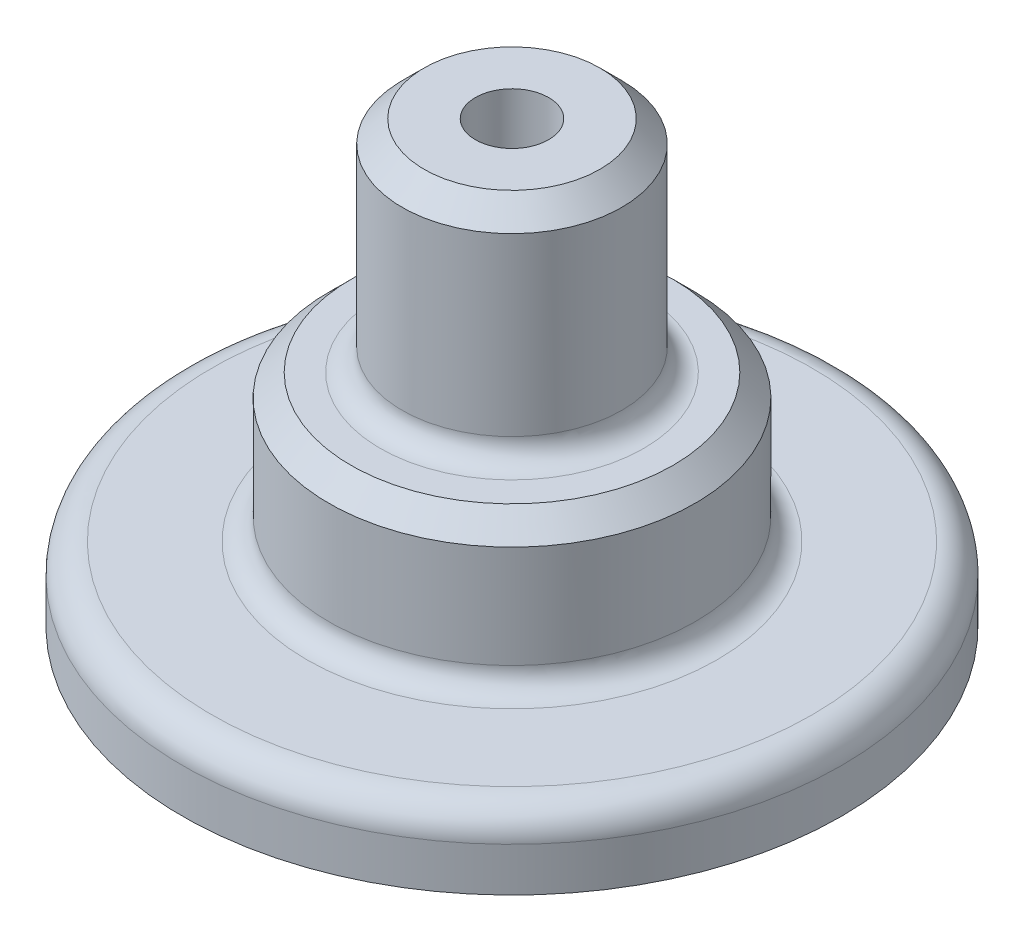
ISO-10303-21;
HEADER;
FILE_DESCRIPTION(('STEP AP214'),'2;1');
FILE_NAME('part.step','',(''),(''),'','','');
FILE_SCHEMA(('AUTOMOTIVE_DESIGN { 1 0 10303 214 1 1 1 1 }'));
ENDSEC;
DATA;
#1=APPLICATION_CONTEXT('core data for automotive mechanical design processes');
#2=APPLICATION_PROTOCOL_DEFINITION('international standard','automotive_design',2000,#1);
#3=PRODUCT_CONTEXT('',#1,'mechanical');
#4=PRODUCT('Part','Part','',(#3));
#5=PRODUCT_RELATED_PRODUCT_CATEGORY('part','',(#4));
#6=PRODUCT_DEFINITION_FORMATION('','',#4);
#7=PRODUCT_DEFINITION_CONTEXT('part definition',#1,'design');
#8=PRODUCT_DEFINITION('design','',#6,#7);
#9=PRODUCT_DEFINITION_SHAPE('','',#8);
#10=(LENGTH_UNIT() NAMED_UNIT(*) SI_UNIT(.MILLI.,.METRE.));
#11=(NAMED_UNIT(*) PLANE_ANGLE_UNIT() SI_UNIT($,.RADIAN.));
#12=(NAMED_UNIT(*) SI_UNIT($,.STERADIAN.) SOLID_ANGLE_UNIT());
#13=UNCERTAINTY_MEASURE_WITH_UNIT(LENGTH_MEASURE(1.E-05),#10,'distance_accuracy_value','');
#14=(GEOMETRIC_REPRESENTATION_CONTEXT(3) GLOBAL_UNCERTAINTY_ASSIGNED_CONTEXT((#13)) GLOBAL_UNIT_ASSIGNED_CONTEXT((#10,
#11,#12)) REPRESENTATION_CONTEXT('',''));
#15=CARTESIAN_POINT('',(0.,0.,0.));
#16=DIRECTION('',(0.,0.,1.));
#17=DIRECTION('',(1.,0.,0.));
#18=AXIS2_PLACEMENT_3D('',#15,#16,#17);
#19=CARTESIAN_POINT('',(40.,120.,0.));
#20=DIRECTION('',(0.,-1.,0.));
#21=DIRECTION('',(1.,0.,0.));
#22=AXIS2_PLACEMENT_3D('',#19,#20,#21);
#23=PLANE('',#22);
#24=CARTESIAN_POINT('',(9.99999999999999,120.,0.));
#25=DIRECTION('',(0.,-1.,0.));
#26=DIRECTION('',(1.,0.,0.));
#27=AXIS2_PLACEMENT_3D('',#24,#25,#26);
#28=CIRCLE('',#27,24.);
#29=CARTESIAN_POINT('',(34.,120.,0.));
#30=VERTEX_POINT('',#29);
#31=EDGE_CURVE('E38',#30,#30,#28,.F.);
#32=ORIENTED_EDGE('',*,*,#31,.T.);
#33=EDGE_LOOP('',(#32));
#34=FACE_BOUND('',#33,.T.);
#35=CARTESIAN_POINT('',(9.99999999999999,120.,0.));
#36=DIRECTION('',(0.,-1.,0.));
#37=DIRECTION('',(1.,0.,0.));
#38=AXIS2_PLACEMENT_3D('',#35,#36,#37);
#39=CIRCLE('',#38,10.);
#40=CARTESIAN_POINT('',(20.,120.,0.));
#41=VERTEX_POINT('',#40);
#42=EDGE_CURVE('E72',#41,#41,#39,.F.);
#43=ORIENTED_EDGE('',*,*,#42,.F.);
#44=EDGE_LOOP('',(#43));
#45=FACE_BOUND('',#44,.T.);
#46=ADVANCED_FACE('F31',(#34,#45),#23,.F.);
#47=CARTESIAN_POINT('',(10.,0.,0.));
#48=DIRECTION('',(0.,1.,0.));
#49=DIRECTION('',(-1.,0.,0.));
#50=AXIS2_PLACEMENT_3D('',#47,#48,#49);
#51=PLANE('',#50);
#52=CARTESIAN_POINT('',(10.,0.,0.));
#53=DIRECTION('',(0.,1.,0.));
#54=DIRECTION('',(-1.,0.,0.));
#55=AXIS2_PLACEMENT_3D('',#52,#53,#54);
#56=CIRCLE('',#55,10.);
#57=CARTESIAN_POINT('',(0.,0.,0.));
#58=VERTEX_POINT('',#57);
#59=EDGE_CURVE('E75',#58,#58,#56,.T.);
#60=ORIENTED_EDGE('',*,*,#59,.T.);
#61=EDGE_LOOP('',(#60));
#62=FACE_BOUND('',#61,.T.);
#63=CARTESIAN_POINT('',(10.,0.,0.));
#64=DIRECTION('',(0.,1.,0.));
#65=DIRECTION('',(-1.,0.,0.));
#66=AXIS2_PLACEMENT_3D('',#63,#64,#65);
#67=CIRCLE('',#66,90.);
#68=CARTESIAN_POINT('',(-80.,0.,0.));
#69=VERTEX_POINT('',#68);
#70=EDGE_CURVE('E69',#69,#69,#67,.T.);
#71=ORIENTED_EDGE('',*,*,#70,.F.);
#72=EDGE_LOOP('',(#71));
#73=FACE_BOUND('',#72,.T.);
#74=ADVANCED_FACE('F79',(#62,#73),#51,.F.);
#75=CARTESIAN_POINT('',(9.99999999999999,120.,0.));
#76=DIRECTION('',(0.,1.,0.));
#77=DIRECTION('',(-1.,0.,0.));
#78=AXIS2_PLACEMENT_3D('',#75,#76,#77);
#79=CYLINDRICAL_SURFACE('',#78,90.);
#80=CARTESIAN_POINT('',(10.,12.,0.));
#81=DIRECTION('',(0.,-1.,0.));
#82=DIRECTION('',(1.,0.,0.));
#83=AXIS2_PLACEMENT_3D('',#80,#81,#82);
#84=CIRCLE('',#83,90.);
#85=CARTESIAN_POINT('',(100.,12.,0.));
#86=VERTEX_POINT('',#85);
#87=EDGE_CURVE('E63',#86,#86,#84,.T.);
#88=ORIENTED_EDGE('',*,*,#87,.T.);
#89=EDGE_LOOP('',(#88));
#90=FACE_BOUND('',#89,.T.);
#91=ORIENTED_EDGE('',*,*,#70,.T.);
#92=EDGE_LOOP('',(#91));
#93=FACE_BOUND('',#92,.T.);
#94=ADVANCED_FACE('F95',(#90,#93),#79,.T.);
#95=CARTESIAN_POINT('',(100.,20.,0.));
#96=DIRECTION('',(0.,-1.,0.));
#97=DIRECTION('',(1.,0.,0.));
#98=AXIS2_PLACEMENT_3D('',#95,#96,#97);
#99=PLANE('',#98);
#100=CARTESIAN_POINT('',(10.,20.,0.));
#101=DIRECTION('',(0.,-1.,0.));
#102=DIRECTION('',(1.,0.,0.));
#103=AXIS2_PLACEMENT_3D('',#100,#101,#102);
#104=CIRCLE('',#103,56.);
#105=CARTESIAN_POINT('',(66.,20.,0.));
#106=VERTEX_POINT('',#105);
#107=EDGE_CURVE('E57',#106,#106,#104,.T.);
#108=ORIENTED_EDGE('',*,*,#107,.T.);
#109=EDGE_LOOP('',(#108));
#110=FACE_BOUND('',#109,.T.);
#111=CARTESIAN_POINT('',(10.,20.,0.));
#112=DIRECTION('',(0.,-1.,0.));
#113=DIRECTION('',(1.,0.,0.));
#114=AXIS2_PLACEMENT_3D('',#111,#112,#113);
#115=CIRCLE('',#114,82.);
#116=CARTESIAN_POINT('',(92.,20.,0.));
#117=VERTEX_POINT('',#116);
#118=EDGE_CURVE('E66',#117,#117,#115,.F.);
#119=ORIENTED_EDGE('',*,*,#118,.T.);
#120=EDGE_LOOP('',(#119));
#121=FACE_BOUND('',#120,.T.);
#122=ADVANCED_FACE('F136',(#110,#121),#99,.F.);
#123=CARTESIAN_POINT('',(9.99999999999999,120.,0.));
#124=DIRECTION('',(0.,1.,0.));
#125=DIRECTION('',(-1.,0.,0.));
#126=AXIS2_PLACEMENT_3D('',#123,#124,#125);
#127=CYLINDRICAL_SURFACE('',#126,50.);
#128=CARTESIAN_POINT('',(9.99999999999999,53.9999999999999,0.));
#129=DIRECTION('',(0.,-1.,0.));
#130=DIRECTION('',(0.,0.,-1.));
#131=AXIS2_PLACEMENT_3D('',#128,#129,#130);
#132=CIRCLE('',#131,50.);
#133=CARTESIAN_POINT('',(9.99999999999999,53.9999999999999,-50.));
#134=VERTEX_POINT('',#133);
#135=EDGE_CURVE('E42',#134,#134,#132,.T.);
#136=ORIENTED_EDGE('',*,*,#135,.T.);
#137=EDGE_LOOP('',(#136));
#138=FACE_BOUND('',#137,.T.);
#139=CARTESIAN_POINT('',(10.,26.,0.));
#140=DIRECTION('',(0.,-1.,0.));
#141=DIRECTION('',(1.,0.,0.));
#142=AXIS2_PLACEMENT_3D('',#139,#140,#141);
#143=CIRCLE('',#142,50.);
#144=CARTESIAN_POINT('',(60.,26.,0.));
#145=VERTEX_POINT('',#144);
#146=EDGE_CURVE('E60',#145,#145,#143,.F.);
#147=ORIENTED_EDGE('',*,*,#146,.T.);
#148=EDGE_LOOP('',(#147));
#149=FACE_BOUND('',#148,.T.);
#150=ADVANCED_FACE('F123',(#138,#149),#127,.T.);
#151=CARTESIAN_POINT('',(60.,60.,0.));
#152=DIRECTION('',(0.,-1.,0.));
#153=DIRECTION('',(1.,0.,0.));
#154=AXIS2_PLACEMENT_3D('',#151,#152,#153);
#155=PLANE('',#154);
#156=CARTESIAN_POINT('',(9.99999999999999,60.,0.));
#157=DIRECTION('',(0.,-1.,0.));
#158=DIRECTION('',(1.,0.,0.));
#159=AXIS2_PLACEMENT_3D('',#156,#157,#158);
#160=CIRCLE('',#159,43.9999999999999);
#161=CARTESIAN_POINT('',(53.9999999999999,60.,0.));
#162=VERTEX_POINT('',#161);
#163=EDGE_CURVE('E46',#162,#162,#160,.F.);
#164=ORIENTED_EDGE('',*,*,#163,.T.);
#165=EDGE_LOOP('',(#164));
#166=FACE_BOUND('',#165,.T.);
#167=CARTESIAN_POINT('',(9.99999999999999,60.,0.));
#168=DIRECTION('',(0.,-1.,0.));
#169=DIRECTION('',(1.,0.,0.));
#170=AXIS2_PLACEMENT_3D('',#167,#168,#169);
#171=CIRCLE('',#170,36.);
#172=CARTESIAN_POINT('',(46.,60.,0.));
#173=VERTEX_POINT('',#172);
#174=EDGE_CURVE('E51',#173,#173,#171,.T.);
#175=ORIENTED_EDGE('',*,*,#174,.T.);
#176=EDGE_LOOP('',(#175));
#177=FACE_BOUND('',#176,.T.);
#178=ADVANCED_FACE('F120',(#166,#177),#155,.F.);
#179=CARTESIAN_POINT('',(9.99999999999999,120.,0.));
#180=DIRECTION('',(0.,1.,0.));
#181=DIRECTION('',(-1.,0.,0.));
#182=AXIS2_PLACEMENT_3D('',#179,#180,#181);
#183=CYLINDRICAL_SURFACE('',#182,30.);
#184=CARTESIAN_POINT('',(9.99999999999999,114.,0.));
#185=DIRECTION('',(0.,-1.,0.));
#186=DIRECTION('',(0.,0.,-1.));
#187=AXIS2_PLACEMENT_3D('',#184,#185,#186);
#188=CIRCLE('',#187,30.);
#189=CARTESIAN_POINT('',(9.99999999999999,114.,-30.));
#190=VERTEX_POINT('',#189);
#191=EDGE_CURVE('E10',#190,#190,#188,.T.);
#192=ORIENTED_EDGE('',*,*,#191,.T.);
#193=EDGE_LOOP('',(#192));
#194=FACE_BOUND('',#193,.T.);
#195=CARTESIAN_POINT('',(9.99999999999999,66.,0.));
#196=DIRECTION('',(0.,-1.,0.));
#197=DIRECTION('',(1.,0.,0.));
#198=AXIS2_PLACEMENT_3D('',#195,#196,#197);
#199=CIRCLE('',#198,30.);
#200=CARTESIAN_POINT('',(40.,66.,0.));
#201=VERTEX_POINT('',#200);
#202=EDGE_CURVE('E54',#201,#201,#199,.F.);
#203=ORIENTED_EDGE('',*,*,#202,.T.);
#204=EDGE_LOOP('',(#203));
#205=FACE_BOUND('',#204,.T.);
#206=ADVANCED_FACE('F103',(#194,#205),#183,.T.);
#207=CARTESIAN_POINT('',(10.,12.,0.));
#208=DIRECTION('',(0.,-1.,0.));
#209=DIRECTION('',(1.,0.,0.));
#210=AXIS2_PLACEMENT_3D('',#207,#208,#209);
#211=TOROIDAL_SURFACE('',#210,82.,8.);
#212=ORIENTED_EDGE('',*,*,#87,.F.);
#213=EDGE_LOOP('',(#212));
#214=FACE_BOUND('',#213,.T.);
#215=ORIENTED_EDGE('',*,*,#118,.F.);
#216=EDGE_LOOP('',(#215));
#217=FACE_BOUND('',#216,.T.);
#218=ADVANCED_FACE('F99',(#214,#217),#211,.T.);
#219=CARTESIAN_POINT('',(10.,26.,0.));
#220=DIRECTION('',(0.,-1.,0.));
#221=DIRECTION('',(1.,0.,0.));
#222=AXIS2_PLACEMENT_3D('',#219,#220,#221);
#223=TOROIDAL_SURFACE('',#222,56.,6.);
#224=ORIENTED_EDGE('',*,*,#107,.F.);
#225=EDGE_LOOP('',(#224));
#226=FACE_BOUND('',#225,.T.);
#227=ORIENTED_EDGE('',*,*,#146,.F.);
#228=EDGE_LOOP('',(#227));
#229=FACE_BOUND('',#228,.T.);
#230=ADVANCED_FACE('F102',(#226,#229),#223,.F.);
#231=CARTESIAN_POINT('',(9.99999999999999,66.,0.));
#232=DIRECTION('',(0.,-1.,0.));
#233=DIRECTION('',(1.,0.,0.));
#234=AXIS2_PLACEMENT_3D('',#231,#232,#233);
#235=TOROIDAL_SURFACE('',#234,36.,6.);
#236=ORIENTED_EDGE('',*,*,#174,.F.);
#237=EDGE_LOOP('',(#236));
#238=FACE_BOUND('',#237,.T.);
#239=ORIENTED_EDGE('',*,*,#202,.F.);
#240=EDGE_LOOP('',(#239));
#241=FACE_BOUND('',#240,.T.);
#242=ADVANCED_FACE('F86',(#238,#241),#235,.F.);
#243=CARTESIAN_POINT('',(9.99999999999999,130.,0.));
#244=DIRECTION('',(0.,-1.,0.));
#245=DIRECTION('',(1.,0.,0.));
#246=AXIS2_PLACEMENT_3D('',#243,#244,#245);
#247=CYLINDRICAL_SURFACE('',#246,10.);
#248=ORIENTED_EDGE('',*,*,#59,.F.);
#249=EDGE_LOOP('',(#248));
#250=FACE_BOUND('',#249,.T.);
#251=ORIENTED_EDGE('',*,*,#42,.T.);
#252=EDGE_LOOP('',(#251));
#253=FACE_BOUND('',#252,.T.);
#254=ADVANCED_FACE('F82',(#250,#253),#247,.F.);
#255=CARTESIAN_POINT('',(9.99999999999999,60.,0.));
#256=DIRECTION('',(0.,-1.,0.));
#257=DIRECTION('',(0.,0.,-1.));
#258=AXIS2_PLACEMENT_3D('',#255,#256,#257);
#259=CONICAL_SURFACE('',#258,43.9999999999999,0.785398163397449);
#260=ORIENTED_EDGE('',*,*,#135,.F.);
#261=EDGE_LOOP('',(#260));
#262=FACE_BOUND('',#261,.T.);
#263=ORIENTED_EDGE('',*,*,#163,.F.);
#264=EDGE_LOOP('',(#263));
#265=FACE_BOUND('',#264,.T.);
#266=ADVANCED_FACE('F85',(#262,#265),#259,.T.);
#267=CARTESIAN_POINT('',(9.99999999999999,120.,0.));
#268=DIRECTION('',(0.,-1.,0.));
#269=DIRECTION('',(0.,0.,-1.));
#270=AXIS2_PLACEMENT_3D('',#267,#268,#269);
#271=CONICAL_SURFACE('',#270,24.,0.785398163397449);
#272=ORIENTED_EDGE('',*,*,#191,.F.);
#273=EDGE_LOOP('',(#272));
#274=FACE_BOUND('',#273,.T.);
#275=ORIENTED_EDGE('',*,*,#31,.F.);
#276=EDGE_LOOP('',(#275));
#277=FACE_BOUND('',#276,.T.);
#278=ADVANCED_FACE('F33',(#274,#277),#271,.T.);
#279=CLOSED_SHELL('',(#46,#74,#94,#122,#150,#178,#206,#218,#230,#242,#254,#266,#278));
#280=MANIFOLD_SOLID_BREP('B2',#279);
#281=ADVANCED_BREP_SHAPE_REPRESENTATION('',(#18,#280),#14);
#282=SHAPE_DEFINITION_REPRESENTATION(#9,#281);
ENDSEC;
END-ISO-10303-21;
